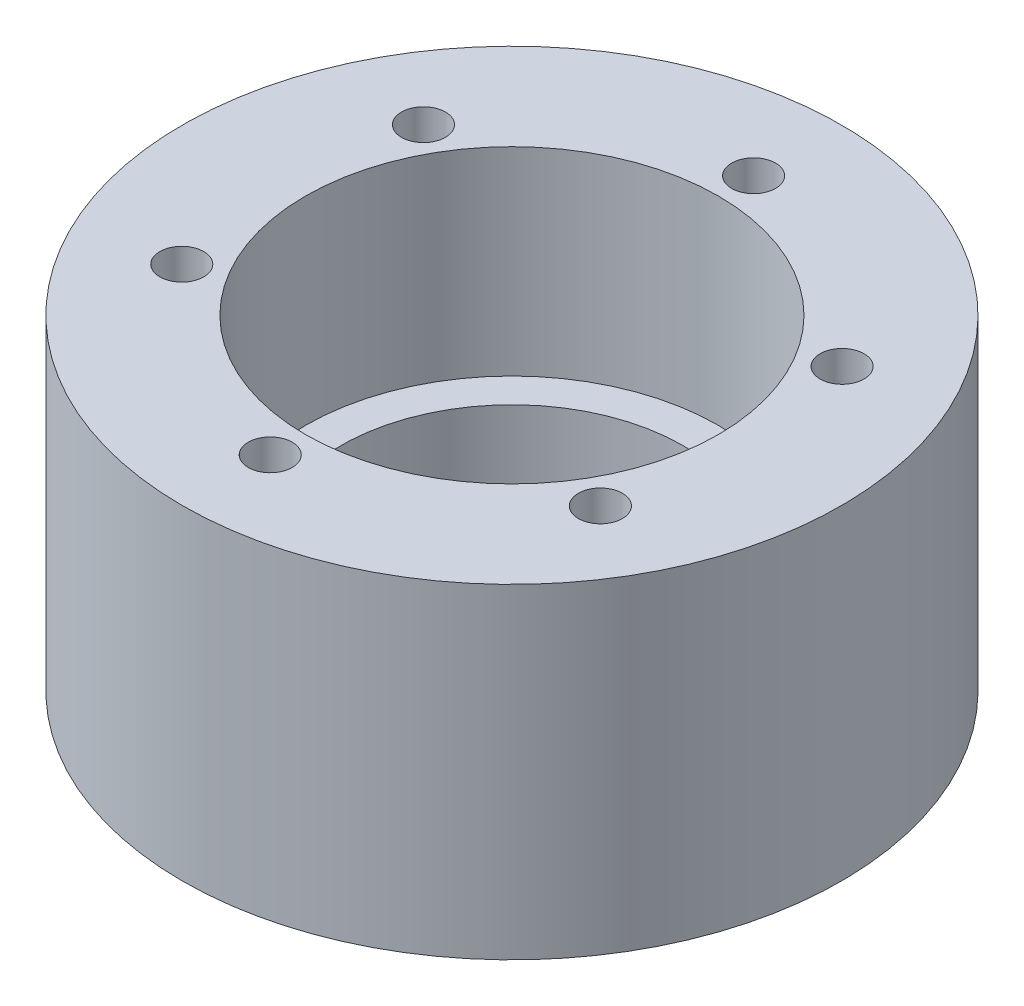
ISO-10303-21;
HEADER;
FILE_DESCRIPTION(('STEP AP214'),'2;1');
FILE_NAME('part.step','',(''),(''),'','','');
FILE_SCHEMA(('AUTOMOTIVE_DESIGN { 1 0 10303 214 1 1 1 1 }'));
ENDSEC;
DATA;
#1=APPLICATION_CONTEXT('core data for automotive mechanical design processes');
#2=APPLICATION_PROTOCOL_DEFINITION('international standard','automotive_design',2000,#1);
#3=PRODUCT_CONTEXT('',#1,'mechanical');
#4=PRODUCT('Part','Part','',(#3));
#5=PRODUCT_RELATED_PRODUCT_CATEGORY('part','',(#4));
#6=PRODUCT_DEFINITION_FORMATION('','',#4);
#7=PRODUCT_DEFINITION_CONTEXT('part definition',#1,'design');
#8=PRODUCT_DEFINITION('design','',#6,#7);
#9=PRODUCT_DEFINITION_SHAPE('','',#8);
#10=(LENGTH_UNIT() NAMED_UNIT(*) SI_UNIT(.MILLI.,.METRE.));
#11=(NAMED_UNIT(*) PLANE_ANGLE_UNIT() SI_UNIT($,.RADIAN.));
#12=(NAMED_UNIT(*) SI_UNIT($,.STERADIAN.) SOLID_ANGLE_UNIT());
#13=UNCERTAINTY_MEASURE_WITH_UNIT(LENGTH_MEASURE(1.E-05),#10,'distance_accuracy_value','');
#14=(GEOMETRIC_REPRESENTATION_CONTEXT(3) GLOBAL_UNCERTAINTY_ASSIGNED_CONTEXT((#13)) GLOBAL_UNIT_ASSIGNED_CONTEXT((#10,
#11,#12)) REPRESENTATION_CONTEXT('',''));
#15=CARTESIAN_POINT('',(0.,0.,0.));
#16=DIRECTION('',(0.,0.,1.));
#17=DIRECTION('',(1.,0.,0.));
#18=AXIS2_PLACEMENT_3D('',#15,#16,#17);
#19=CARTESIAN_POINT('',(0.,37.,0.));
#20=DIRECTION('',(0.,-1.,0.));
#21=DIRECTION('',(0.,0.,-1.));
#22=AXIS2_PLACEMENT_3D('',#19,#20,#21);
#23=CYLINDRICAL_SURFACE('',#22,37.5);
#24=CARTESIAN_POINT('',(0.,37.,0.));
#25=DIRECTION('',(0.,1.,0.));
#26=DIRECTION('',(0.,0.,1.));
#27=AXIS2_PLACEMENT_3D('',#24,#25,#26);
#28=CIRCLE('',#27,37.5);
#29=CARTESIAN_POINT('',(0.,37.,37.5));
#30=VERTEX_POINT('',#29);
#31=EDGE_CURVE('E11',#30,#30,#28,.T.);
#32=ORIENTED_EDGE('',*,*,#31,.F.);
#33=EDGE_LOOP('',(#32));
#34=FACE_BOUND('',#33,.T.);
#35=CARTESIAN_POINT('',(0.,0.,0.));
#36=DIRECTION('',(0.,1.,0.));
#37=DIRECTION('',(0.,0.,1.));
#38=AXIS2_PLACEMENT_3D('',#35,#36,#37);
#39=CIRCLE('',#38,37.5);
#40=CARTESIAN_POINT('',(0.,0.,37.5));
#41=VERTEX_POINT('',#40);
#42=EDGE_CURVE('E54',#41,#41,#39,.T.);
#43=ORIENTED_EDGE('',*,*,#42,.T.);
#44=EDGE_LOOP('',(#43));
#45=FACE_BOUND('',#44,.T.);
#46=ADVANCED_FACE('F45',(#34,#45),#23,.T.);
#47=CARTESIAN_POINT('',(0.,37.,0.));
#48=DIRECTION('',(0.,1.,0.));
#49=DIRECTION('',(0.,0.,1.));
#50=AXIS2_PLACEMENT_3D('',#47,#48,#49);
#51=PLANE('',#50);
#52=CARTESIAN_POINT('',(0.,37.,-27.5));
#53=DIRECTION('',(0.,1.,0.));
#54=DIRECTION('',(0.,0.,1.));
#55=AXIS2_PLACEMENT_3D('',#52,#53,#54);
#56=CIRCLE('',#55,2.5);
#57=CARTESIAN_POINT('',(0.,37.,-25.));
#58=VERTEX_POINT('',#57);
#59=EDGE_CURVE('E104',#58,#58,#56,.T.);
#60=ORIENTED_EDGE('',*,*,#59,.F.);
#61=EDGE_LOOP('',(#60));
#62=FACE_BOUND('',#61,.T.);
#63=CARTESIAN_POINT('',(23.8156986040726,37.,-13.750000000001));
#64=DIRECTION('',(0.,1.,0.));
#65=DIRECTION('',(0.,0.,1.));
#66=AXIS2_PLACEMENT_3D('',#63,#64,#65);
#67=CIRCLE('',#66,2.5);
#68=CARTESIAN_POINT('',(23.8156986040726,37.,-11.250000000001));
#69=VERTEX_POINT('',#68);
#70=EDGE_CURVE('E103',#69,#69,#67,.T.);
#71=ORIENTED_EDGE('',*,*,#70,.F.);
#72=EDGE_LOOP('',(#71));
#73=FACE_BOUND('',#72,.T.);
#74=CARTESIAN_POINT('',(23.8156986040738,37.,13.749999999999));
#75=DIRECTION('',(0.,1.,0.));
#76=DIRECTION('',(0.,0.,1.));
#77=AXIS2_PLACEMENT_3D('',#74,#75,#76);
#78=CIRCLE('',#77,2.5);
#79=CARTESIAN_POINT('',(23.8156986040738,37.,16.249999999999));
#80=VERTEX_POINT('',#79);
#81=EDGE_CURVE('E117',#80,#80,#78,.T.);
#82=ORIENTED_EDGE('',*,*,#81,.F.);
#83=EDGE_LOOP('',(#82));
#84=FACE_BOUND('',#83,.T.);
#85=CARTESIAN_POINT('',(2.33468769191537E-12,37.,27.5));
#86=DIRECTION('',(0.,1.,0.));
#87=DIRECTION('',(0.,0.,1.));
#88=AXIS2_PLACEMENT_3D('',#85,#86,#87);
#89=CIRCLE('',#88,2.5);
#90=CARTESIAN_POINT('',(2.33468769191537E-12,37.,30.));
#91=VERTEX_POINT('',#90);
#92=EDGE_CURVE('E125',#91,#91,#89,.T.);
#93=ORIENTED_EDGE('',*,*,#92,.F.);
#94=EDGE_LOOP('',(#93));
#95=FACE_BOUND('',#94,.T.);
#96=CARTESIAN_POINT('',(-23.8156986040703,37.,13.750000000001));
#97=DIRECTION('',(0.,1.,0.));
#98=DIRECTION('',(0.,0.,1.));
#99=AXIS2_PLACEMENT_3D('',#96,#97,#98);
#100=CIRCLE('',#99,2.5);
#101=CARTESIAN_POINT('',(-23.8156986040703,37.,16.250000000001));
#102=VERTEX_POINT('',#101);
#103=EDGE_CURVE('E133',#102,#102,#100,.T.);
#104=ORIENTED_EDGE('',*,*,#103,.F.);
#105=EDGE_LOOP('',(#104));
#106=FACE_BOUND('',#105,.T.);
#107=CARTESIAN_POINT('',(-23.8156986040715,37.,-13.749999999999));
#108=DIRECTION('',(0.,1.,0.));
#109=DIRECTION('',(0.,0.,1.));
#110=AXIS2_PLACEMENT_3D('',#107,#108,#109);
#111=CIRCLE('',#110,2.5);
#112=CARTESIAN_POINT('',(-23.8156986040715,37.,-11.249999999999));
#113=VERTEX_POINT('',#112);
#114=EDGE_CURVE('E141',#113,#113,#111,.T.);
#115=ORIENTED_EDGE('',*,*,#114,.F.);
#116=EDGE_LOOP('',(#115));
#117=FACE_BOUND('',#116,.T.);
#118=CARTESIAN_POINT('',(0.,37.,0.));
#119=DIRECTION('',(0.,1.,0.));
#120=DIRECTION('',(0.,0.,1.));
#121=AXIS2_PLACEMENT_3D('',#118,#119,#120);
#122=CIRCLE('',#121,23.5);
#123=CARTESIAN_POINT('',(0.,37.,23.5));
#124=VERTEX_POINT('',#123);
#125=EDGE_CURVE('E205',#124,#124,#122,.T.);
#126=ORIENTED_EDGE('',*,*,#125,.F.);
#127=EDGE_LOOP('',(#126));
#128=FACE_BOUND('',#127,.T.);
#129=ORIENTED_EDGE('',*,*,#31,.T.);
#130=EDGE_LOOP('',(#129));
#131=FACE_BOUND('',#130,.T.);
#132=ADVANCED_FACE('F216',(#62,#73,#84,#95,#106,#117,#128,#131),#51,.T.);
#133=CARTESIAN_POINT('',(0.,0.,0.));
#134=DIRECTION('',(0.,1.,0.));
#135=DIRECTION('',(0.,0.,1.));
#136=AXIS2_PLACEMENT_3D('',#133,#134,#135);
#137=PLANE('',#136);
#138=CARTESIAN_POINT('',(0.,0.,31.));
#139=DIRECTION('',(0.,-1.,0.));
#140=DIRECTION('',(0.,0.,-1.));
#141=AXIS2_PLACEMENT_3D('',#138,#139,#140);
#142=CIRCLE('',#141,2.49999999999999);
#143=CARTESIAN_POINT('',(0.,0.,28.5));
#144=VERTEX_POINT('',#143);
#145=EDGE_CURVE('E149',#144,#144,#142,.T.);
#146=ORIENTED_EDGE('',*,*,#145,.F.);
#147=EDGE_LOOP('',(#146));
#148=FACE_BOUND('',#147,.T.);
#149=CARTESIAN_POINT('',(26.8467875173181,0.,15.5000000000009));
#150=DIRECTION('',(0.,-1.,0.));
#151=DIRECTION('',(0.,0.,-1.));
#152=AXIS2_PLACEMENT_3D('',#149,#150,#151);
#153=CIRCLE('',#152,2.49999999999999);
#154=CARTESIAN_POINT('',(26.8467875173181,0.,13.0000000000009));
#155=VERTEX_POINT('',#154);
#156=EDGE_CURVE('E157',#155,#155,#153,.T.);
#157=ORIENTED_EDGE('',*,*,#156,.F.);
#158=EDGE_LOOP('',(#157));
#159=FACE_BOUND('',#158,.T.);
#160=CARTESIAN_POINT('',(26.8467875173191,0.,-15.4999999999991));
#161=DIRECTION('',(0.,-1.,0.));
#162=DIRECTION('',(0.,0.,-1.));
#163=AXIS2_PLACEMENT_3D('',#160,#161,#162);
#164=CIRCLE('',#163,2.49999999999999);
#165=CARTESIAN_POINT('',(26.8467875173191,0.,-17.9999999999991));
#166=VERTEX_POINT('',#165);
#167=EDGE_CURVE('E165',#166,#166,#164,.T.);
#168=ORIENTED_EDGE('',*,*,#167,.F.);
#169=EDGE_LOOP('',(#168));
#170=FACE_BOUND('',#169,.T.);
#171=CARTESIAN_POINT('',(1.99601524000885E-12,0.,-31.));
#172=DIRECTION('',(0.,-1.,0.));
#173=DIRECTION('',(0.,0.,-1.));
#174=AXIS2_PLACEMENT_3D('',#171,#172,#173);
#175=CIRCLE('',#174,2.49999999999999);
#176=CARTESIAN_POINT('',(1.99601524000885E-12,0.,-33.5));
#177=VERTEX_POINT('',#176);
#178=EDGE_CURVE('E173',#177,#177,#175,.T.);
#179=ORIENTED_EDGE('',*,*,#178,.F.);
#180=EDGE_LOOP('',(#179));
#181=FACE_BOUND('',#180,.T.);
#182=CARTESIAN_POINT('',(-26.8467875173161,0.,-15.5000000000009));
#183=DIRECTION('',(0.,-1.,0.));
#184=DIRECTION('',(0.,0.,-1.));
#185=AXIS2_PLACEMENT_3D('',#182,#183,#184);
#186=CIRCLE('',#185,2.49999999999999);
#187=CARTESIAN_POINT('',(-26.8467875173161,0.,-18.0000000000009));
#188=VERTEX_POINT('',#187);
#189=EDGE_CURVE('E181',#188,#188,#186,.T.);
#190=ORIENTED_EDGE('',*,*,#189,.F.);
#191=EDGE_LOOP('',(#190));
#192=FACE_BOUND('',#191,.T.);
#193=CARTESIAN_POINT('',(-26.8467875173171,0.,15.4999999999991));
#194=DIRECTION('',(0.,-1.,0.));
#195=DIRECTION('',(0.,0.,-1.));
#196=AXIS2_PLACEMENT_3D('',#193,#194,#195);
#197=CIRCLE('',#196,2.49999999999999);
#198=CARTESIAN_POINT('',(-26.8467875173171,0.,12.9999999999991));
#199=VERTEX_POINT('',#198);
#200=EDGE_CURVE('E189',#199,#199,#197,.T.);
#201=ORIENTED_EDGE('',*,*,#200,.F.);
#202=EDGE_LOOP('',(#201));
#203=FACE_BOUND('',#202,.T.);
#204=CARTESIAN_POINT('',(0.,0.,0.));
#205=DIRECTION('',(0.,-1.,0.));
#206=DIRECTION('',(0.,0.,-1.));
#207=AXIS2_PLACEMENT_3D('',#204,#205,#206);
#208=CIRCLE('',#207,19.5);
#209=CARTESIAN_POINT('',(0.,0.,-19.5));
#210=VERTEX_POINT('',#209);
#211=EDGE_CURVE('E197',#210,#210,#208,.T.);
#212=ORIENTED_EDGE('',*,*,#211,.F.);
#213=EDGE_LOOP('',(#212));
#214=FACE_BOUND('',#213,.T.);
#215=ORIENTED_EDGE('',*,*,#42,.F.);
#216=EDGE_LOOP('',(#215));
#217=FACE_BOUND('',#216,.T.);
#218=ADVANCED_FACE('F213',(#148,#159,#170,#181,#192,#203,#214,#217),#137,.F.);
#219=CARTESIAN_POINT('',(0.,14.4,0.));
#220=DIRECTION('',(0.,1.,0.));
#221=DIRECTION('',(0.,0.,1.));
#222=AXIS2_PLACEMENT_3D('',#219,#220,#221);
#223=CYLINDRICAL_SURFACE('',#222,23.5);
#224=CARTESIAN_POINT('',(0.,14.4,0.));
#225=DIRECTION('',(0.,1.,0.));
#226=DIRECTION('',(0.,0.,1.));
#227=AXIS2_PLACEMENT_3D('',#224,#225,#226);
#228=CIRCLE('',#227,23.5);
#229=CARTESIAN_POINT('',(0.,14.4,23.5));
#230=VERTEX_POINT('',#229);
#231=EDGE_CURVE('E201',#230,#230,#228,.T.);
#232=ORIENTED_EDGE('',*,*,#231,.F.);
#233=EDGE_LOOP('',(#232));
#234=FACE_BOUND('',#233,.T.);
#235=ORIENTED_EDGE('',*,*,#125,.T.);
#236=EDGE_LOOP('',(#235));
#237=FACE_BOUND('',#236,.T.);
#238=ADVANCED_FACE('F215',(#234,#237),#223,.F.);
#239=CARTESIAN_POINT('',(0.,14.4,0.));
#240=DIRECTION('',(0.,1.,0.));
#241=DIRECTION('',(0.,0.,1.));
#242=AXIS2_PLACEMENT_3D('',#239,#240,#241);
#243=PLANE('',#242);
#244=CARTESIAN_POINT('',(0.,14.4,0.));
#245=DIRECTION('',(0.,1.,0.));
#246=DIRECTION('',(0.,0.,1.));
#247=AXIS2_PLACEMENT_3D('',#244,#245,#246);
#248=CIRCLE('',#247,19.5);
#249=CARTESIAN_POINT('',(0.,14.4,19.5));
#250=VERTEX_POINT('',#249);
#251=EDGE_CURVE('E48',#250,#250,#248,.T.);
#252=ORIENTED_EDGE('',*,*,#251,.F.);
#253=EDGE_LOOP('',(#252));
#254=FACE_BOUND('',#253,.T.);
#255=ORIENTED_EDGE('',*,*,#231,.T.);
#256=EDGE_LOOP('',(#255));
#257=FACE_BOUND('',#256,.T.);
#258=ADVANCED_FACE('F222',(#254,#257),#243,.T.);
#259=CARTESIAN_POINT('',(0.,37.,0.));
#260=DIRECTION('',(0.,-1.,0.));
#261=DIRECTION('',(0.,0.,-1.));
#262=AXIS2_PLACEMENT_3D('',#259,#260,#261);
#263=CYLINDRICAL_SURFACE('',#262,19.5);
#264=ORIENTED_EDGE('',*,*,#251,.T.);
#265=EDGE_LOOP('',(#264));
#266=FACE_BOUND('',#265,.T.);
#267=ORIENTED_EDGE('',*,*,#211,.T.);
#268=EDGE_LOOP('',(#267));
#269=FACE_BOUND('',#268,.T.);
#270=ADVANCED_FACE('F413',(#266,#269),#263,.F.);
#271=CARTESIAN_POINT('',(-26.8467875173171,16.,15.4999999999991));
#272=DIRECTION('',(0.,-1.,0.));
#273=DIRECTION('',(0.,0.,-1.));
#274=AXIS2_PLACEMENT_3D('',#271,#272,#273);
#275=CONICAL_SURFACE('',#274,2.5,1.02974425867665);
#276=CARTESIAN_POINT('',(-26.8467875173171,17.5021515475689,15.4999999999991));
#277=VERTEX_POINT('',#276);
#278=VERTEX_LOOP('',#277);
#279=FACE_BOUND('',#278,.T.);
#280=CARTESIAN_POINT('',(-26.8467875173171,16.,15.4999999999991));
#281=DIRECTION('',(0.,-1.,0.));
#282=DIRECTION('',(0.,0.,-1.));
#283=AXIS2_PLACEMENT_3D('',#280,#281,#282);
#284=CIRCLE('',#283,2.5);
#285=CARTESIAN_POINT('',(-26.8467875173171,16.,12.9999999999991));
#286=VERTEX_POINT('',#285);
#287=EDGE_CURVE('E193',#286,#286,#284,.T.);
#288=ORIENTED_EDGE('',*,*,#287,.T.);
#289=EDGE_LOOP('',(#288));
#290=FACE_BOUND('',#289,.T.);
#291=ADVANCED_FACE('F409',(#279,#290),#275,.F.);
#292=CARTESIAN_POINT('',(-26.8467875173171,0.,15.4999999999991));
#293=DIRECTION('',(0.,-1.,0.));
#294=DIRECTION('',(0.,0.,-1.));
#295=AXIS2_PLACEMENT_3D('',#292,#293,#294);
#296=CYLINDRICAL_SURFACE('',#295,2.49999999999999);
#297=ORIENTED_EDGE('',*,*,#287,.F.);
#298=EDGE_LOOP('',(#297));
#299=FACE_BOUND('',#298,.T.);
#300=ORIENTED_EDGE('',*,*,#200,.T.);
#301=EDGE_LOOP('',(#300));
#302=FACE_BOUND('',#301,.T.);
#303=ADVANCED_FACE('F406',(#299,#302),#296,.F.);
#304=CARTESIAN_POINT('',(-26.8467875173161,16.,-15.5000000000009));
#305=DIRECTION('',(0.,-1.,0.));
#306=DIRECTION('',(0.,0.,-1.));
#307=AXIS2_PLACEMENT_3D('',#304,#305,#306);
#308=CONICAL_SURFACE('',#307,2.5,1.02974425867665);
#309=CARTESIAN_POINT('',(-26.8467875173161,17.5021515475689,-15.5000000000009));
#310=VERTEX_POINT('',#309);
#311=VERTEX_LOOP('',#310);
#312=FACE_BOUND('',#311,.T.);
#313=CARTESIAN_POINT('',(-26.8467875173161,16.,-15.5000000000009));
#314=DIRECTION('',(0.,-1.,0.));
#315=DIRECTION('',(0.,0.,-1.));
#316=AXIS2_PLACEMENT_3D('',#313,#314,#315);
#317=CIRCLE('',#316,2.5);
#318=CARTESIAN_POINT('',(-26.8467875173161,16.,-18.0000000000009));
#319=VERTEX_POINT('',#318);
#320=EDGE_CURVE('E185',#319,#319,#317,.T.);
#321=ORIENTED_EDGE('',*,*,#320,.T.);
#322=EDGE_LOOP('',(#321));
#323=FACE_BOUND('',#322,.T.);
#324=ADVANCED_FACE('F402',(#312,#323),#308,.F.);
#325=CARTESIAN_POINT('',(-26.8467875173161,0.,-15.5000000000009));
#326=DIRECTION('',(0.,-1.,0.));
#327=DIRECTION('',(0.,0.,-1.));
#328=AXIS2_PLACEMENT_3D('',#325,#326,#327);
#329=CYLINDRICAL_SURFACE('',#328,2.49999999999999);
#330=ORIENTED_EDGE('',*,*,#320,.F.);
#331=EDGE_LOOP('',(#330));
#332=FACE_BOUND('',#331,.T.);
#333=ORIENTED_EDGE('',*,*,#189,.T.);
#334=EDGE_LOOP('',(#333));
#335=FACE_BOUND('',#334,.T.);
#336=ADVANCED_FACE('F398',(#332,#335),#329,.F.);
#337=CARTESIAN_POINT('',(1.99601524000885E-12,16.,-31.));
#338=DIRECTION('',(0.,-1.,0.));
#339=DIRECTION('',(0.,0.,-1.));
#340=AXIS2_PLACEMENT_3D('',#337,#338,#339);
#341=CONICAL_SURFACE('',#340,2.5,1.02974425867665);
#342=CARTESIAN_POINT('',(1.99172844923467E-12,17.5021515475689,-31.));
#343=VERTEX_POINT('',#342);
#344=VERTEX_LOOP('',#343);
#345=FACE_BOUND('',#344,.T.);
#346=CARTESIAN_POINT('',(1.99601524000885E-12,16.,-31.));
#347=DIRECTION('',(0.,-1.,0.));
#348=DIRECTION('',(0.,0.,-1.));
#349=AXIS2_PLACEMENT_3D('',#346,#347,#348);
#350=CIRCLE('',#349,2.5);
#351=CARTESIAN_POINT('',(1.99601524000885E-12,16.,-33.5));
#352=VERTEX_POINT('',#351);
#353=EDGE_CURVE('E177',#352,#352,#350,.T.);
#354=ORIENTED_EDGE('',*,*,#353,.T.);
#355=EDGE_LOOP('',(#354));
#356=FACE_BOUND('',#355,.T.);
#357=ADVANCED_FACE('F394',(#345,#356),#341,.F.);
#358=CARTESIAN_POINT('',(1.99601524000885E-12,0.,-31.));
#359=DIRECTION('',(0.,-1.,0.));
#360=DIRECTION('',(0.,0.,-1.));
#361=AXIS2_PLACEMENT_3D('',#358,#359,#360);
#362=CYLINDRICAL_SURFACE('',#361,2.49999999999999);
#363=ORIENTED_EDGE('',*,*,#353,.F.);
#364=EDGE_LOOP('',(#363));
#365=FACE_BOUND('',#364,.T.);
#366=ORIENTED_EDGE('',*,*,#178,.T.);
#367=EDGE_LOOP('',(#366));
#368=FACE_BOUND('',#367,.T.);
#369=ADVANCED_FACE('F390',(#365,#368),#362,.F.);
#370=CARTESIAN_POINT('',(26.8467875173191,16.,-15.4999999999991));
#371=DIRECTION('',(0.,-1.,0.));
#372=DIRECTION('',(0.,0.,-1.));
#373=AXIS2_PLACEMENT_3D('',#370,#371,#372);
#374=CONICAL_SURFACE('',#373,2.5,1.02974425867665);
#375=CARTESIAN_POINT('',(26.8467875173191,17.5021515475689,-15.4999999999991));
#376=VERTEX_POINT('',#375);
#377=VERTEX_LOOP('',#376);
#378=FACE_BOUND('',#377,.T.);
#379=CARTESIAN_POINT('',(26.8467875173191,16.,-15.4999999999991));
#380=DIRECTION('',(0.,-1.,0.));
#381=DIRECTION('',(0.,0.,-1.));
#382=AXIS2_PLACEMENT_3D('',#379,#380,#381);
#383=CIRCLE('',#382,2.5);
#384=CARTESIAN_POINT('',(26.8467875173191,16.,-17.9999999999991));
#385=VERTEX_POINT('',#384);
#386=EDGE_CURVE('E169',#385,#385,#383,.T.);
#387=ORIENTED_EDGE('',*,*,#386,.T.);
#388=EDGE_LOOP('',(#387));
#389=FACE_BOUND('',#388,.T.);
#390=ADVANCED_FACE('F386',(#378,#389),#374,.F.);
#391=CARTESIAN_POINT('',(26.8467875173191,0.,-15.4999999999991));
#392=DIRECTION('',(0.,-1.,0.));
#393=DIRECTION('',(0.,0.,-1.));
#394=AXIS2_PLACEMENT_3D('',#391,#392,#393);
#395=CYLINDRICAL_SURFACE('',#394,2.49999999999999);
#396=ORIENTED_EDGE('',*,*,#386,.F.);
#397=EDGE_LOOP('',(#396));
#398=FACE_BOUND('',#397,.T.);
#399=ORIENTED_EDGE('',*,*,#167,.T.);
#400=EDGE_LOOP('',(#399));
#401=FACE_BOUND('',#400,.T.);
#402=ADVANCED_FACE('F382',(#398,#401),#395,.F.);
#403=CARTESIAN_POINT('',(26.8467875173181,16.,15.5000000000009));
#404=DIRECTION('',(0.,-1.,0.));
#405=DIRECTION('',(0.,0.,-1.));
#406=AXIS2_PLACEMENT_3D('',#403,#404,#405);
#407=CONICAL_SURFACE('',#406,2.5,1.02974425867665);
#408=CARTESIAN_POINT('',(26.8467875173181,17.5021515475689,15.5000000000009));
#409=VERTEX_POINT('',#408);
#410=VERTEX_LOOP('',#409);
#411=FACE_BOUND('',#410,.T.);
#412=CARTESIAN_POINT('',(26.8467875173181,16.,15.5000000000009));
#413=DIRECTION('',(0.,-1.,0.));
#414=DIRECTION('',(0.,0.,-1.));
#415=AXIS2_PLACEMENT_3D('',#412,#413,#414);
#416=CIRCLE('',#415,2.5);
#417=CARTESIAN_POINT('',(26.8467875173181,16.,13.0000000000009));
#418=VERTEX_POINT('',#417);
#419=EDGE_CURVE('E161',#418,#418,#416,.T.);
#420=ORIENTED_EDGE('',*,*,#419,.T.);
#421=EDGE_LOOP('',(#420));
#422=FACE_BOUND('',#421,.T.);
#423=ADVANCED_FACE('F378',(#411,#422),#407,.F.);
#424=CARTESIAN_POINT('',(26.8467875173181,0.,15.5000000000009));
#425=DIRECTION('',(0.,-1.,0.));
#426=DIRECTION('',(0.,0.,-1.));
#427=AXIS2_PLACEMENT_3D('',#424,#425,#426);
#428=CYLINDRICAL_SURFACE('',#427,2.49999999999999);
#429=ORIENTED_EDGE('',*,*,#419,.F.);
#430=EDGE_LOOP('',(#429));
#431=FACE_BOUND('',#430,.T.);
#432=ORIENTED_EDGE('',*,*,#156,.T.);
#433=EDGE_LOOP('',(#432));
#434=FACE_BOUND('',#433,.T.);
#435=ADVANCED_FACE('F374',(#431,#434),#428,.F.);
#436=CARTESIAN_POINT('',(0.,16.,31.));
#437=DIRECTION('',(0.,-1.,0.));
#438=DIRECTION('',(0.,0.,-1.));
#439=AXIS2_PLACEMENT_3D('',#436,#437,#438);
#440=CONICAL_SURFACE('',#439,2.5,1.02974425867665);
#441=CARTESIAN_POINT('',(0.,17.5021515475689,31.));
#442=VERTEX_POINT('',#441);
#443=VERTEX_LOOP('',#442);
#444=FACE_BOUND('',#443,.T.);
#445=CARTESIAN_POINT('',(0.,16.,31.));
#446=DIRECTION('',(0.,-1.,0.));
#447=DIRECTION('',(0.,0.,-1.));
#448=AXIS2_PLACEMENT_3D('',#445,#446,#447);
#449=CIRCLE('',#448,2.5);
#450=CARTESIAN_POINT('',(0.,16.,28.5));
#451=VERTEX_POINT('',#450);
#452=EDGE_CURVE('E153',#451,#451,#449,.T.);
#453=ORIENTED_EDGE('',*,*,#452,.T.);
#454=EDGE_LOOP('',(#453));
#455=FACE_BOUND('',#454,.T.);
#456=ADVANCED_FACE('F370',(#444,#455),#440,.F.);
#457=CARTESIAN_POINT('',(0.,0.,31.));
#458=DIRECTION('',(0.,-1.,0.));
#459=DIRECTION('',(0.,0.,-1.));
#460=AXIS2_PLACEMENT_3D('',#457,#458,#459);
#461=CYLINDRICAL_SURFACE('',#460,2.49999999999999);
#462=ORIENTED_EDGE('',*,*,#452,.F.);
#463=EDGE_LOOP('',(#462));
#464=FACE_BOUND('',#463,.T.);
#465=ORIENTED_EDGE('',*,*,#145,.T.);
#466=EDGE_LOOP('',(#465));
#467=FACE_BOUND('',#466,.T.);
#468=ADVANCED_FACE('F249',(#464,#467),#461,.F.);
#469=CARTESIAN_POINT('',(-23.8156986040715,21.,-13.749999999999));
#470=DIRECTION('',(0.,1.,0.));
#471=DIRECTION('',(0.,0.,1.));
#472=AXIS2_PLACEMENT_3D('',#469,#470,#471);
#473=CONICAL_SURFACE('',#472,2.5,1.02974425867665);
#474=CARTESIAN_POINT('',(-23.8156986040715,19.4978484524311,-13.749999999999));
#475=VERTEX_POINT('',#474);
#476=VERTEX_LOOP('',#475);
#477=FACE_BOUND('',#476,.T.);
#478=CARTESIAN_POINT('',(-23.8156986040715,21.,-13.749999999999));
#479=DIRECTION('',(0.,1.,0.));
#480=DIRECTION('',(0.,0.,1.));
#481=AXIS2_PLACEMENT_3D('',#478,#479,#480);
#482=CIRCLE('',#481,2.5);
#483=CARTESIAN_POINT('',(-23.8156986040715,21.,-11.249999999999));
#484=VERTEX_POINT('',#483);
#485=EDGE_CURVE('E145',#484,#484,#482,.T.);
#486=ORIENTED_EDGE('',*,*,#485,.T.);
#487=EDGE_LOOP('',(#486));
#488=FACE_BOUND('',#487,.T.);
#489=ADVANCED_FACE('F254',(#477,#488),#473,.F.);
#490=CARTESIAN_POINT('',(-23.8156986040715,37.,-13.749999999999));
#491=DIRECTION('',(0.,1.,0.));
#492=DIRECTION('',(0.,0.,1.));
#493=AXIS2_PLACEMENT_3D('',#490,#491,#492);
#494=CYLINDRICAL_SURFACE('',#493,2.5);
#495=ORIENTED_EDGE('',*,*,#485,.F.);
#496=EDGE_LOOP('',(#495));
#497=FACE_BOUND('',#496,.T.);
#498=ORIENTED_EDGE('',*,*,#114,.T.);
#499=EDGE_LOOP('',(#498));
#500=FACE_BOUND('',#499,.T.);
#501=ADVANCED_FACE('F259',(#497,#500),#494,.F.);
#502=CARTESIAN_POINT('',(-23.8156986040703,21.,13.750000000001));
#503=DIRECTION('',(0.,1.,0.));
#504=DIRECTION('',(0.,0.,1.));
#505=AXIS2_PLACEMENT_3D('',#502,#503,#504);
#506=CONICAL_SURFACE('',#505,2.5,1.02974425867665);
#507=CARTESIAN_POINT('',(-23.8156986040703,19.4978484524311,13.750000000001));
#508=VERTEX_POINT('',#507);
#509=VERTEX_LOOP('',#508);
#510=FACE_BOUND('',#509,.T.);
#511=CARTESIAN_POINT('',(-23.8156986040703,21.,13.750000000001));
#512=DIRECTION('',(0.,1.,0.));
#513=DIRECTION('',(0.,0.,1.));
#514=AXIS2_PLACEMENT_3D('',#511,#512,#513);
#515=CIRCLE('',#514,2.5);
#516=CARTESIAN_POINT('',(-23.8156986040703,21.,16.250000000001));
#517=VERTEX_POINT('',#516);
#518=EDGE_CURVE('E137',#517,#517,#515,.T.);
#519=ORIENTED_EDGE('',*,*,#518,.T.);
#520=EDGE_LOOP('',(#519));
#521=FACE_BOUND('',#520,.T.);
#522=ADVANCED_FACE('F270',(#510,#521),#506,.F.);
#523=CARTESIAN_POINT('',(-23.8156986040703,37.,13.750000000001));
#524=DIRECTION('',(0.,1.,0.));
#525=DIRECTION('',(0.,0.,1.));
#526=AXIS2_PLACEMENT_3D('',#523,#524,#525);
#527=CYLINDRICAL_SURFACE('',#526,2.5);
#528=ORIENTED_EDGE('',*,*,#518,.F.);
#529=EDGE_LOOP('',(#528));
#530=FACE_BOUND('',#529,.T.);
#531=ORIENTED_EDGE('',*,*,#103,.T.);
#532=EDGE_LOOP('',(#531));
#533=FACE_BOUND('',#532,.T.);
#534=ADVANCED_FACE('F280',(#530,#533),#527,.F.);
#535=CARTESIAN_POINT('',(2.33468769191537E-12,21.,27.5));
#536=DIRECTION('',(0.,1.,0.));
#537=DIRECTION('',(0.,0.,1.));
#538=AXIS2_PLACEMENT_3D('',#535,#536,#537);
#539=CONICAL_SURFACE('',#538,2.5,1.02974425867665);
#540=CARTESIAN_POINT('',(2.33042247428214E-12,19.4978484524311,27.5));
#541=VERTEX_POINT('',#540);
#542=VERTEX_LOOP('',#541);
#543=FACE_BOUND('',#542,.T.);
#544=CARTESIAN_POINT('',(2.33468769191537E-12,21.,27.5));
#545=DIRECTION('',(0.,1.,0.));
#546=DIRECTION('',(0.,0.,1.));
#547=AXIS2_PLACEMENT_3D('',#544,#545,#546);
#548=CIRCLE('',#547,2.5);
#549=CARTESIAN_POINT('',(2.33468769191537E-12,21.,30.));
#550=VERTEX_POINT('',#549);
#551=EDGE_CURVE('E129',#550,#550,#548,.T.);
#552=ORIENTED_EDGE('',*,*,#551,.T.);
#553=EDGE_LOOP('',(#552));
#554=FACE_BOUND('',#553,.T.);
#555=ADVANCED_FACE('F290',(#543,#554),#539,.F.);
#556=CARTESIAN_POINT('',(2.33468769191537E-12,37.,27.5));
#557=DIRECTION('',(0.,1.,0.));
#558=DIRECTION('',(0.,0.,1.));
#559=AXIS2_PLACEMENT_3D('',#556,#557,#558);
#560=CYLINDRICAL_SURFACE('',#559,2.5);
#561=ORIENTED_EDGE('',*,*,#551,.F.);
#562=EDGE_LOOP('',(#561));
#563=FACE_BOUND('',#562,.T.);
#564=ORIENTED_EDGE('',*,*,#92,.T.);
#565=EDGE_LOOP('',(#564));
#566=FACE_BOUND('',#565,.T.);
#567=ADVANCED_FACE('F300',(#563,#566),#560,.F.);
#568=CARTESIAN_POINT('',(23.8156986040738,21.,13.749999999999));
#569=DIRECTION('',(0.,1.,0.));
#570=DIRECTION('',(0.,0.,1.));
#571=AXIS2_PLACEMENT_3D('',#568,#569,#570);
#572=CONICAL_SURFACE('',#571,2.5,1.02974425867665);
#573=CARTESIAN_POINT('',(23.8156986040738,19.4978484524311,13.749999999999));
#574=VERTEX_POINT('',#573);
#575=VERTEX_LOOP('',#574);
#576=FACE_BOUND('',#575,.T.);
#577=CARTESIAN_POINT('',(23.8156986040738,21.,13.749999999999));
#578=DIRECTION('',(0.,1.,0.));
#579=DIRECTION('',(0.,0.,1.));
#580=AXIS2_PLACEMENT_3D('',#577,#578,#579);
#581=CIRCLE('',#580,2.5);
#582=CARTESIAN_POINT('',(23.8156986040738,21.,16.249999999999));
#583=VERTEX_POINT('',#582);
#584=EDGE_CURVE('E121',#583,#583,#581,.T.);
#585=ORIENTED_EDGE('',*,*,#584,.T.);
#586=EDGE_LOOP('',(#585));
#587=FACE_BOUND('',#586,.T.);
#588=ADVANCED_FACE('F310',(#576,#587),#572,.F.);
#589=CARTESIAN_POINT('',(23.8156986040738,37.,13.749999999999));
#590=DIRECTION('',(0.,1.,0.));
#591=DIRECTION('',(0.,0.,1.));
#592=AXIS2_PLACEMENT_3D('',#589,#590,#591);
#593=CYLINDRICAL_SURFACE('',#592,2.5);
#594=ORIENTED_EDGE('',*,*,#584,.F.);
#595=EDGE_LOOP('',(#594));
#596=FACE_BOUND('',#595,.T.);
#597=ORIENTED_EDGE('',*,*,#81,.T.);
#598=EDGE_LOOP('',(#597));
#599=FACE_BOUND('',#598,.T.);
#600=ADVANCED_FACE('F320',(#596,#599),#593,.F.);
#601=CARTESIAN_POINT('',(23.8156986040726,21.,-13.750000000001));
#602=DIRECTION('',(0.,1.,0.));
#603=DIRECTION('',(0.,0.,1.));
#604=AXIS2_PLACEMENT_3D('',#601,#602,#603);
#605=CONICAL_SURFACE('',#604,2.5,1.02974425867665);
#606=CARTESIAN_POINT('',(23.8156986040726,19.4978484524311,-13.750000000001));
#607=VERTEX_POINT('',#606);
#608=VERTEX_LOOP('',#607);
#609=FACE_BOUND('',#608,.T.);
#610=CARTESIAN_POINT('',(23.8156986040726,21.,-13.750000000001));
#611=DIRECTION('',(0.,1.,0.));
#612=DIRECTION('',(0.,0.,1.));
#613=AXIS2_PLACEMENT_3D('',#610,#611,#612);
#614=CIRCLE('',#613,2.5);
#615=CARTESIAN_POINT('',(23.8156986040726,21.,-11.250000000001));
#616=VERTEX_POINT('',#615);
#617=EDGE_CURVE('E109',#616,#616,#614,.T.);
#618=ORIENTED_EDGE('',*,*,#617,.T.);
#619=EDGE_LOOP('',(#618));
#620=FACE_BOUND('',#619,.T.);
#621=ADVANCED_FACE('F330',(#609,#620),#605,.F.);
#622=CARTESIAN_POINT('',(23.8156986040726,37.,-13.750000000001));
#623=DIRECTION('',(0.,1.,0.));
#624=DIRECTION('',(0.,0.,1.));
#625=AXIS2_PLACEMENT_3D('',#622,#623,#624);
#626=CYLINDRICAL_SURFACE('',#625,2.5);
#627=ORIENTED_EDGE('',*,*,#617,.F.);
#628=EDGE_LOOP('',(#627));
#629=FACE_BOUND('',#628,.T.);
#630=ORIENTED_EDGE('',*,*,#70,.T.);
#631=EDGE_LOOP('',(#630));
#632=FACE_BOUND('',#631,.T.);
#633=ADVANCED_FACE('F96',(#629,#632),#626,.F.);
#634=CARTESIAN_POINT('',(0.,21.,-27.5));
#635=DIRECTION('',(0.,1.,0.));
#636=DIRECTION('',(0.,0.,1.));
#637=AXIS2_PLACEMENT_3D('',#634,#635,#636);
#638=CONICAL_SURFACE('',#637,2.5,1.02974425867665);
#639=CARTESIAN_POINT('',(0.,19.4978484524311,-27.5));
#640=VERTEX_POINT('',#639);
#641=VERTEX_LOOP('',#640);
#642=FACE_BOUND('',#641,.T.);
#643=CARTESIAN_POINT('',(0.,21.,-27.5));
#644=DIRECTION('',(0.,1.,0.));
#645=DIRECTION('',(0.,0.,1.));
#646=AXIS2_PLACEMENT_3D('',#643,#644,#645);
#647=CIRCLE('',#646,2.5);
#648=CARTESIAN_POINT('',(0.,21.,-25.));
#649=VERTEX_POINT('',#648);
#650=EDGE_CURVE('E100',#649,#649,#647,.T.);
#651=ORIENTED_EDGE('',*,*,#650,.T.);
#652=EDGE_LOOP('',(#651));
#653=FACE_BOUND('',#652,.T.);
#654=ADVANCED_FACE('F92',(#642,#653),#638,.F.);
#655=CARTESIAN_POINT('',(0.,37.,-27.5));
#656=DIRECTION('',(0.,1.,0.));
#657=DIRECTION('',(0.,0.,1.));
#658=AXIS2_PLACEMENT_3D('',#655,#656,#657);
#659=CYLINDRICAL_SURFACE('',#658,2.5);
#660=ORIENTED_EDGE('',*,*,#650,.F.);
#661=EDGE_LOOP('',(#660));
#662=FACE_BOUND('',#661,.T.);
#663=ORIENTED_EDGE('',*,*,#59,.T.);
#664=EDGE_LOOP('',(#663));
#665=FACE_BOUND('',#664,.T.);
#666=ADVANCED_FACE('F95',(#662,#665),#659,.F.);
#667=CLOSED_SHELL('',(#46,#132,#218,#238,#258,#270,#291,#303,#324,#336,#357,#369,#390,#402,#423,
#435,#456,#468,#489,#501,#522,#534,#555,#567,#588,#600,#621,#633,#654,#666));
#668=MANIFOLD_SOLID_BREP('B2',#667);
#669=ADVANCED_BREP_SHAPE_REPRESENTATION('',(#18,#668),#14);
#670=SHAPE_DEFINITION_REPRESENTATION(#9,#669);
ENDSEC;
END-ISO-10303-21;
